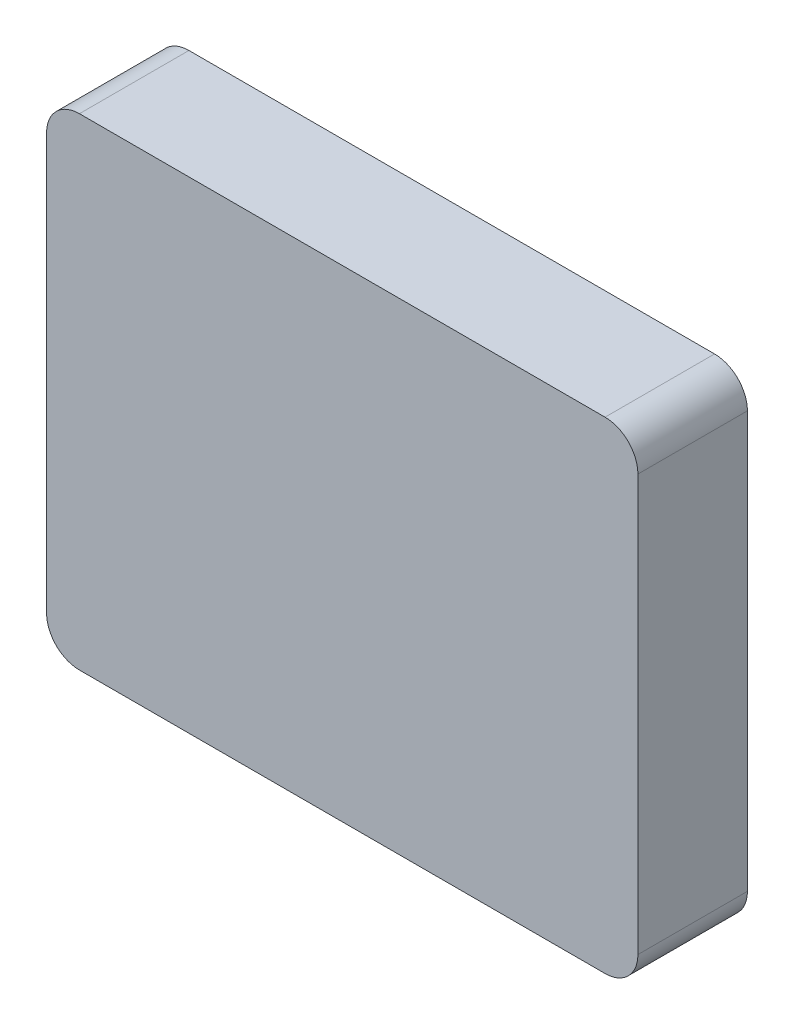
ISO-10303-21;
HEADER;
FILE_DESCRIPTION(('STEP AP214'),'2;1');
FILE_NAME('part.step','',(''),(''),'','','');
FILE_SCHEMA(('AUTOMOTIVE_DESIGN { 1 0 10303 214 1 1 1 1 }'));
ENDSEC;
DATA;
#1=APPLICATION_CONTEXT('core data for automotive mechanical design processes');
#2=APPLICATION_PROTOCOL_DEFINITION('international standard','automotive_design',2000,#1);
#3=PRODUCT_CONTEXT('',#1,'mechanical');
#4=PRODUCT('Part','Part','',(#3));
#5=PRODUCT_RELATED_PRODUCT_CATEGORY('part','',(#4));
#6=PRODUCT_DEFINITION_FORMATION('','',#4);
#7=PRODUCT_DEFINITION_CONTEXT('part definition',#1,'design');
#8=PRODUCT_DEFINITION('design','',#6,#7);
#9=PRODUCT_DEFINITION_SHAPE('','',#8);
#10=(LENGTH_UNIT() NAMED_UNIT(*) SI_UNIT(.MILLI.,.METRE.));
#11=(NAMED_UNIT(*) PLANE_ANGLE_UNIT() SI_UNIT($,.RADIAN.));
#12=(NAMED_UNIT(*) SI_UNIT($,.STERADIAN.) SOLID_ANGLE_UNIT());
#13=UNCERTAINTY_MEASURE_WITH_UNIT(LENGTH_MEASURE(1.E-05),#10,'distance_accuracy_value','');
#14=(GEOMETRIC_REPRESENTATION_CONTEXT(3) GLOBAL_UNCERTAINTY_ASSIGNED_CONTEXT((#13)) GLOBAL_UNIT_ASSIGNED_CONTEXT((#10,
#11,#12)) REPRESENTATION_CONTEXT('',''));
#15=CARTESIAN_POINT('',(0.,0.,0.));
#16=DIRECTION('',(0.,0.,1.));
#17=DIRECTION('',(1.,0.,0.));
#18=AXIS2_PLACEMENT_3D('',#15,#16,#17);
#19=CARTESIAN_POINT('',(0.,0.,0.));
#20=DIRECTION('',(0.,0.,1.));
#21=DIRECTION('',(1.,0.,0.));
#22=AXIS2_PLACEMENT_3D('',#19,#20,#21);
#23=PLANE('',#22);
#24=CARTESIAN_POINT('',(12.,9.5,0.));
#25=DIRECTION('',(0.,0.,1.));
#26=DIRECTION('',(1.,0.,0.));
#27=AXIS2_PLACEMENT_3D('',#24,#25,#26);
#28=CIRCLE('',#27,1.5);
#29=CARTESIAN_POINT('',(12.,11.,0.));
#30=VERTEX_POINT('',#29);
#31=CARTESIAN_POINT('',(13.5,9.5,0.));
#32=VERTEX_POINT('',#31);
#33=EDGE_CURVE('E36',#30,#32,#28,.F.);
#34=ORIENTED_EDGE('',*,*,#33,.T.);
#35=DIRECTION('',(0.,1.,0.));
#36=VECTOR('',#35,1.);
#37=CARTESIAN_POINT('',(13.5,11.,0.));
#38=LINE('',#37,#36);
#39=CARTESIAN_POINT('',(13.5,-9.5,0.));
#40=VERTEX_POINT('',#39);
#41=EDGE_CURVE('E203',#40,#32,#38,.T.);
#42=ORIENTED_EDGE('',*,*,#41,.F.);
#43=CARTESIAN_POINT('',(12.,-9.5,0.));
#44=DIRECTION('',(0.,0.,1.));
#45=DIRECTION('',(1.,0.,0.));
#46=AXIS2_PLACEMENT_3D('',#43,#44,#45);
#47=CIRCLE('',#46,1.5);
#48=CARTESIAN_POINT('',(12.,-11.,0.));
#49=VERTEX_POINT('',#48);
#50=EDGE_CURVE('E199',#40,#49,#47,.F.);
#51=ORIENTED_EDGE('',*,*,#50,.T.);
#52=DIRECTION('',(1.,0.,0.));
#53=VECTOR('',#52,1.);
#54=CARTESIAN_POINT('',(13.5,-11.,0.));
#55=LINE('',#54,#53);
#56=CARTESIAN_POINT('',(-12.,-11.,0.));
#57=VERTEX_POINT('',#56);
#58=EDGE_CURVE('E200',#57,#49,#55,.T.);
#59=ORIENTED_EDGE('',*,*,#58,.F.);
#60=CARTESIAN_POINT('',(-12.,-9.5,0.));
#61=DIRECTION('',(0.,0.,1.));
#62=DIRECTION('',(1.,0.,0.));
#63=AXIS2_PLACEMENT_3D('',#60,#61,#62);
#64=CIRCLE('',#63,1.5);
#65=CARTESIAN_POINT('',(-13.5,-9.5,0.));
#66=VERTEX_POINT('',#65);
#67=EDGE_CURVE('E196',#57,#66,#64,.F.);
#68=ORIENTED_EDGE('',*,*,#67,.T.);
#69=DIRECTION('',(0.,-1.,0.));
#70=VECTOR('',#69,1.);
#71=CARTESIAN_POINT('',(-13.5,11.,0.));
#72=LINE('',#71,#70);
#73=CARTESIAN_POINT('',(-13.5,9.5,0.));
#74=VERTEX_POINT('',#73);
#75=EDGE_CURVE('E202',#74,#66,#72,.T.);
#76=ORIENTED_EDGE('',*,*,#75,.F.);
#77=CARTESIAN_POINT('',(-12.,9.5,0.));
#78=DIRECTION('',(0.,0.,1.));
#79=DIRECTION('',(1.,0.,0.));
#80=AXIS2_PLACEMENT_3D('',#77,#78,#79);
#81=CIRCLE('',#80,1.5);
#82=CARTESIAN_POINT('',(-12.,11.,0.));
#83=VERTEX_POINT('',#82);
#84=EDGE_CURVE('E144',#74,#83,#81,.F.);
#85=ORIENTED_EDGE('',*,*,#84,.T.);
#86=DIRECTION('',(-1.,0.,0.));
#87=VECTOR('',#86,1.);
#88=CARTESIAN_POINT('',(13.5,11.,0.));
#89=LINE('',#88,#87);
#90=EDGE_CURVE('E173',#30,#83,#89,.T.);
#91=ORIENTED_EDGE('',*,*,#90,.F.);
#92=EDGE_LOOP('',(#34,#42,#51,#59,#68,#76,#85,#91));
#93=FACE_BOUND('',#92,.T.);
#94=DIRECTION('',(0.,-1.,0.));
#95=VECTOR('',#94,1.);
#96=CARTESIAN_POINT('',(-11.3,11.,0.));
#97=LINE('',#96,#95);
#98=CARTESIAN_POINT('',(-11.3,8.8,0.));
#99=VERTEX_POINT('',#98);
#100=CARTESIAN_POINT('',(-11.3,-8.8,0.));
#101=VERTEX_POINT('',#100);
#102=EDGE_CURVE('E194',#99,#101,#97,.T.);
#103=ORIENTED_EDGE('',*,*,#102,.T.);
#104=DIRECTION('',(1.,0.,0.));
#105=VECTOR('',#104,1.);
#106=CARTESIAN_POINT('',(13.5,-8.8,0.));
#107=LINE('',#106,#105);
#108=CARTESIAN_POINT('',(11.3,-8.8,0.));
#109=VERTEX_POINT('',#108);
#110=EDGE_CURVE('E191',#101,#109,#107,.T.);
#111=ORIENTED_EDGE('',*,*,#110,.T.);
#112=DIRECTION('',(0.,1.,0.));
#113=VECTOR('',#112,1.);
#114=CARTESIAN_POINT('',(11.3,11.,0.));
#115=LINE('',#114,#113);
#116=CARTESIAN_POINT('',(11.3,8.8,0.));
#117=VERTEX_POINT('',#116);
#118=EDGE_CURVE('E41',#109,#117,#115,.T.);
#119=ORIENTED_EDGE('',*,*,#118,.T.);
#120=DIRECTION('',(-1.,0.,0.));
#121=VECTOR('',#120,1.);
#122=CARTESIAN_POINT('',(13.5,8.8,0.));
#123=LINE('',#122,#121);
#124=EDGE_CURVE('E11',#117,#99,#123,.T.);
#125=ORIENTED_EDGE('',*,*,#124,.T.);
#126=EDGE_LOOP('',(#103,#111,#119,#125));
#127=FACE_BOUND('',#126,.T.);
#128=ADVANCED_FACE('F33',(#93,#127),#23,.F.);
#129=CARTESIAN_POINT('',(-11.3,11.,5.));
#130=DIRECTION('',(1.,0.,0.));
#131=DIRECTION('',(0.,1.,0.));
#132=AXIS2_PLACEMENT_3D('',#129,#130,#131);
#133=PLANE('',#132);
#134=ORIENTED_EDGE('',*,*,#102,.F.);
#135=DIRECTION('',(0.,0.,1.));
#136=VECTOR('',#135,1.);
#137=CARTESIAN_POINT('',(-11.3,8.8,5.));
#138=LINE('',#137,#136);
#139=CARTESIAN_POINT('',(-11.3,8.8,2.8));
#140=VERTEX_POINT('',#139);
#141=EDGE_CURVE('E183',#99,#140,#138,.T.);
#142=ORIENTED_EDGE('',*,*,#141,.T.);
#143=DIRECTION('',(0.,-1.,0.));
#144=VECTOR('',#143,1.);
#145=CARTESIAN_POINT('',(-11.3,0.,2.8));
#146=LINE('',#145,#144);
#147=CARTESIAN_POINT('',(-11.3,-8.8,2.8));
#148=VERTEX_POINT('',#147);
#149=EDGE_CURVE('E177',#140,#148,#146,.T.);
#150=ORIENTED_EDGE('',*,*,#149,.T.);
#151=DIRECTION('',(0.,0.,1.));
#152=VECTOR('',#151,1.);
#153=CARTESIAN_POINT('',(-11.3,-8.8,5.));
#154=LINE('',#153,#152);
#155=EDGE_CURVE('E169',#101,#148,#154,.T.);
#156=ORIENTED_EDGE('',*,*,#155,.F.);
#157=EDGE_LOOP('',(#134,#142,#150,#156));
#158=FACE_BOUND('',#157,.T.);
#159=ADVANCED_FACE('F247',(#158),#133,.T.);
#160=CARTESIAN_POINT('',(13.5,-8.8,5.));
#161=DIRECTION('',(0.,1.,0.));
#162=DIRECTION('',(-1.,0.,0.));
#163=AXIS2_PLACEMENT_3D('',#160,#161,#162);
#164=PLANE('',#163);
#165=ORIENTED_EDGE('',*,*,#110,.F.);
#166=ORIENTED_EDGE('',*,*,#155,.T.);
#167=DIRECTION('',(1.,0.,0.));
#168=VECTOR('',#167,1.);
#169=CARTESIAN_POINT('',(0.,-8.8,2.8));
#170=LINE('',#169,#168);
#171=CARTESIAN_POINT('',(11.3,-8.8,2.8));
#172=VERTEX_POINT('',#171);
#173=EDGE_CURVE('E174',#148,#172,#170,.T.);
#174=ORIENTED_EDGE('',*,*,#173,.T.);
#175=DIRECTION('',(0.,0.,1.));
#176=VECTOR('',#175,1.);
#177=CARTESIAN_POINT('',(11.3,-8.8,5.));
#178=LINE('',#177,#176);
#179=EDGE_CURVE('E187',#109,#172,#178,.T.);
#180=ORIENTED_EDGE('',*,*,#179,.F.);
#181=EDGE_LOOP('',(#165,#166,#174,#180));
#182=FACE_BOUND('',#181,.T.);
#183=ADVANCED_FACE('F251',(#182),#164,.T.);
#184=CARTESIAN_POINT('',(11.3,11.,5.));
#185=DIRECTION('',(-1.,0.,0.));
#186=DIRECTION('',(0.,-1.,0.));
#187=AXIS2_PLACEMENT_3D('',#184,#185,#186);
#188=PLANE('',#187);
#189=ORIENTED_EDGE('',*,*,#118,.F.);
#190=ORIENTED_EDGE('',*,*,#179,.T.);
#191=DIRECTION('',(0.,1.,0.));
#192=VECTOR('',#191,1.);
#193=CARTESIAN_POINT('',(11.3,0.,2.8));
#194=LINE('',#193,#192);
#195=CARTESIAN_POINT('',(11.3,8.8,2.8));
#196=VERTEX_POINT('',#195);
#197=EDGE_CURVE('E170',#172,#196,#194,.T.);
#198=ORIENTED_EDGE('',*,*,#197,.T.);
#199=DIRECTION('',(0.,0.,1.));
#200=VECTOR('',#199,1.);
#201=CARTESIAN_POINT('',(11.3,8.8,5.));
#202=LINE('',#201,#200);
#203=EDGE_CURVE('E185',#117,#196,#202,.T.);
#204=ORIENTED_EDGE('',*,*,#203,.F.);
#205=EDGE_LOOP('',(#189,#190,#198,#204));
#206=FACE_BOUND('',#205,.T.);
#207=ADVANCED_FACE('F256',(#206),#188,.T.);
#208=CARTESIAN_POINT('',(13.5,8.8,5.));
#209=DIRECTION('',(0.,-1.,0.));
#210=DIRECTION('',(1.,0.,0.));
#211=AXIS2_PLACEMENT_3D('',#208,#209,#210);
#212=PLANE('',#211);
#213=ORIENTED_EDGE('',*,*,#124,.F.);
#214=ORIENTED_EDGE('',*,*,#203,.T.);
#215=DIRECTION('',(-1.,0.,0.));
#216=VECTOR('',#215,1.);
#217=CARTESIAN_POINT('',(0.,8.8,2.8));
#218=LINE('',#217,#216);
#219=EDGE_CURVE('E180',#196,#140,#218,.T.);
#220=ORIENTED_EDGE('',*,*,#219,.T.);
#221=ORIENTED_EDGE('',*,*,#141,.F.);
#222=EDGE_LOOP('',(#213,#214,#220,#221));
#223=FACE_BOUND('',#222,.T.);
#224=ADVANCED_FACE('F262',(#223),#212,.T.);
#225=CARTESIAN_POINT('',(0.,0.,2.8));
#226=DIRECTION('',(0.,0.,-1.));
#227=DIRECTION('',(-1.,0.,0.));
#228=AXIS2_PLACEMENT_3D('',#225,#226,#227);
#229=PLANE('',#228);
#230=ORIENTED_EDGE('',*,*,#219,.F.);
#231=ORIENTED_EDGE('',*,*,#197,.F.);
#232=ORIENTED_EDGE('',*,*,#173,.F.);
#233=ORIENTED_EDGE('',*,*,#149,.F.);
#234=EDGE_LOOP('',(#230,#231,#232,#233));
#235=FACE_BOUND('',#234,.T.);
#236=ADVANCED_FACE('F265',(#235),#229,.T.);
#237=CARTESIAN_POINT('',(-13.5,11.,5.));
#238=DIRECTION('',(1.,0.,0.));
#239=DIRECTION('',(0.,1.,0.));
#240=AXIS2_PLACEMENT_3D('',#237,#238,#239);
#241=PLANE('',#240);
#242=DIRECTION('',(0.,0.,-1.));
#243=VECTOR('',#242,1.);
#244=CARTESIAN_POINT('',(-13.5,9.5,5.));
#245=LINE('',#244,#243);
#246=CARTESIAN_POINT('',(-13.5,9.5,5.));
#247=VERTEX_POINT('',#246);
#248=EDGE_CURVE('E137',#247,#74,#245,.T.);
#249=ORIENTED_EDGE('',*,*,#248,.T.);
#250=ORIENTED_EDGE('',*,*,#75,.T.);
#251=DIRECTION('',(0.,0.,-1.));
#252=VECTOR('',#251,1.);
#253=CARTESIAN_POINT('',(-13.5,-9.5,5.));
#254=LINE('',#253,#252);
#255=CARTESIAN_POINT('',(-13.5,-9.5,5.));
#256=VERTEX_POINT('',#255);
#257=EDGE_CURVE('E139',#66,#256,#254,.F.);
#258=ORIENTED_EDGE('',*,*,#257,.T.);
#259=DIRECTION('',(0.,-1.,0.));
#260=VECTOR('',#259,1.);
#261=CARTESIAN_POINT('',(-13.5,11.,5.));
#262=LINE('',#261,#260);
#263=EDGE_CURVE('E124',#247,#256,#262,.T.);
#264=ORIENTED_EDGE('',*,*,#263,.F.);
#265=EDGE_LOOP('',(#249,#250,#258,#264));
#266=FACE_BOUND('',#265,.T.);
#267=ADVANCED_FACE('F136',(#266),#241,.F.);
#268=CARTESIAN_POINT('',(13.5,-11.,5.));
#269=DIRECTION('',(0.,1.,0.));
#270=DIRECTION('',(-1.,0.,0.));
#271=AXIS2_PLACEMENT_3D('',#268,#269,#270);
#272=PLANE('',#271);
#273=DIRECTION('',(0.,0.,-1.));
#274=VECTOR('',#273,1.);
#275=CARTESIAN_POINT('',(-12.,-11.,5.));
#276=LINE('',#275,#274);
#277=CARTESIAN_POINT('',(-12.,-11.,5.));
#278=VERTEX_POINT('',#277);
#279=EDGE_CURVE('E164',#278,#57,#276,.T.);
#280=ORIENTED_EDGE('',*,*,#279,.T.);
#281=ORIENTED_EDGE('',*,*,#58,.T.);
#282=DIRECTION('',(0.,0.,-1.));
#283=VECTOR('',#282,1.);
#284=CARTESIAN_POINT('',(12.,-11.,5.));
#285=LINE('',#284,#283);
#286=CARTESIAN_POINT('',(12.,-11.,5.));
#287=VERTEX_POINT('',#286);
#288=EDGE_CURVE('E167',#49,#287,#285,.F.);
#289=ORIENTED_EDGE('',*,*,#288,.T.);
#290=DIRECTION('',(1.,0.,0.));
#291=VECTOR('',#290,1.);
#292=CARTESIAN_POINT('',(13.5,-11.,5.));
#293=LINE('',#292,#291);
#294=EDGE_CURVE('E140',#278,#287,#293,.T.);
#295=ORIENTED_EDGE('',*,*,#294,.F.);
#296=EDGE_LOOP('',(#280,#281,#289,#295));
#297=FACE_BOUND('',#296,.T.);
#298=ADVANCED_FACE('F236',(#297),#272,.F.);
#299=CARTESIAN_POINT('',(13.5,11.,5.));
#300=DIRECTION('',(-1.,0.,0.));
#301=DIRECTION('',(0.,-1.,0.));
#302=AXIS2_PLACEMENT_3D('',#299,#300,#301);
#303=PLANE('',#302);
#304=DIRECTION('',(0.,0.,-1.));
#305=VECTOR('',#304,1.);
#306=CARTESIAN_POINT('',(13.5,-9.5,5.));
#307=LINE('',#306,#305);
#308=CARTESIAN_POINT('',(13.5,-9.5,5.));
#309=VERTEX_POINT('',#308);
#310=EDGE_CURVE('E131',#309,#40,#307,.T.);
#311=ORIENTED_EDGE('',*,*,#310,.T.);
#312=ORIENTED_EDGE('',*,*,#41,.T.);
#313=DIRECTION('',(0.,0.,-1.));
#314=VECTOR('',#313,1.);
#315=CARTESIAN_POINT('',(13.5,9.5,5.));
#316=LINE('',#315,#314);
#317=CARTESIAN_POINT('',(13.5,9.5,5.));
#318=VERTEX_POINT('',#317);
#319=EDGE_CURVE('E162',#32,#318,#316,.F.);
#320=ORIENTED_EDGE('',*,*,#319,.T.);
#321=DIRECTION('',(0.,1.,0.));
#322=VECTOR('',#321,1.);
#323=CARTESIAN_POINT('',(13.5,11.,5.));
#324=LINE('',#323,#322);
#325=EDGE_CURVE('E222',#309,#318,#324,.T.);
#326=ORIENTED_EDGE('',*,*,#325,.F.);
#327=EDGE_LOOP('',(#311,#312,#320,#326));
#328=FACE_BOUND('',#327,.T.);
#329=ADVANCED_FACE('F211',(#328),#303,.F.);
#330=CARTESIAN_POINT('',(13.5,11.,5.));
#331=DIRECTION('',(0.,-1.,0.));
#332=DIRECTION('',(1.,0.,0.));
#333=AXIS2_PLACEMENT_3D('',#330,#331,#332);
#334=PLANE('',#333);
#335=DIRECTION('',(0.,0.,-1.));
#336=VECTOR('',#335,1.);
#337=CARTESIAN_POINT('',(12.,11.,5.));
#338=LINE('',#337,#336);
#339=CARTESIAN_POINT('',(12.,11.,5.));
#340=VERTEX_POINT('',#339);
#341=EDGE_CURVE('E146',#340,#30,#338,.T.);
#342=ORIENTED_EDGE('',*,*,#341,.T.);
#343=ORIENTED_EDGE('',*,*,#90,.T.);
#344=DIRECTION('',(0.,0.,-1.));
#345=VECTOR('',#344,1.);
#346=CARTESIAN_POINT('',(-12.,11.,5.));
#347=LINE('',#346,#345);
#348=CARTESIAN_POINT('',(-12.,11.,5.));
#349=VERTEX_POINT('',#348);
#350=EDGE_CURVE('E149',#83,#349,#347,.F.);
#351=ORIENTED_EDGE('',*,*,#350,.T.);
#352=DIRECTION('',(-1.,0.,0.));
#353=VECTOR('',#352,1.);
#354=CARTESIAN_POINT('',(13.5,11.,5.));
#355=LINE('',#354,#353);
#356=EDGE_CURVE('E127',#340,#349,#355,.T.);
#357=ORIENTED_EDGE('',*,*,#356,.F.);
#358=EDGE_LOOP('',(#342,#343,#351,#357));
#359=FACE_BOUND('',#358,.T.);
#360=ADVANCED_FACE('F224',(#359),#334,.F.);
#361=CARTESIAN_POINT('',(0.,0.,5.));
#362=DIRECTION('',(0.,0.,-1.));
#363=DIRECTION('',(-1.,0.,0.));
#364=AXIS2_PLACEMENT_3D('',#361,#362,#363);
#365=PLANE('',#364);
#366=ORIENTED_EDGE('',*,*,#356,.T.);
#367=CARTESIAN_POINT('',(-12.,9.5,5.));
#368=DIRECTION('',(0.,0.,-1.));
#369=DIRECTION('',(-1.,0.,0.));
#370=AXIS2_PLACEMENT_3D('',#367,#368,#369);
#371=CIRCLE('',#370,1.5);
#372=EDGE_CURVE('E121',#349,#247,#371,.F.);
#373=ORIENTED_EDGE('',*,*,#372,.T.);
#374=ORIENTED_EDGE('',*,*,#263,.T.);
#375=CARTESIAN_POINT('',(-12.,-9.5,5.));
#376=DIRECTION('',(0.,0.,-1.));
#377=DIRECTION('',(-1.,0.,0.));
#378=AXIS2_PLACEMENT_3D('',#375,#376,#377);
#379=CIRCLE('',#378,1.5);
#380=EDGE_CURVE('E155',#256,#278,#379,.F.);
#381=ORIENTED_EDGE('',*,*,#380,.T.);
#382=ORIENTED_EDGE('',*,*,#294,.T.);
#383=CARTESIAN_POINT('',(12.,-9.5,5.));
#384=DIRECTION('',(0.,0.,-1.));
#385=DIRECTION('',(-1.,0.,0.));
#386=AXIS2_PLACEMENT_3D('',#383,#384,#385);
#387=CIRCLE('',#386,1.5);
#388=EDGE_CURVE('E157',#287,#309,#387,.F.);
#389=ORIENTED_EDGE('',*,*,#388,.T.);
#390=ORIENTED_EDGE('',*,*,#325,.T.);
#391=CARTESIAN_POINT('',(12.,9.5,5.));
#392=DIRECTION('',(0.,0.,-1.));
#393=DIRECTION('',(-1.,0.,0.));
#394=AXIS2_PLACEMENT_3D('',#391,#392,#393);
#395=CIRCLE('',#394,1.5);
#396=EDGE_CURVE('E132',#318,#340,#395,.F.);
#397=ORIENTED_EDGE('',*,*,#396,.T.);
#398=EDGE_LOOP('',(#366,#373,#374,#381,#382,#389,#390,#397));
#399=FACE_BOUND('',#398,.T.);
#400=ADVANCED_FACE('F123',(#399),#365,.F.);
#401=CARTESIAN_POINT('',(-12.,9.5,5.));
#402=DIRECTION('',(0.,0.,-1.));
#403=DIRECTION('',(-1.,0.,0.));
#404=AXIS2_PLACEMENT_3D('',#401,#402,#403);
#405=CYLINDRICAL_SURFACE('',#404,1.5);
#406=ORIENTED_EDGE('',*,*,#84,.F.);
#407=ORIENTED_EDGE('',*,*,#248,.F.);
#408=ORIENTED_EDGE('',*,*,#372,.F.);
#409=ORIENTED_EDGE('',*,*,#350,.F.);
#410=EDGE_LOOP('',(#406,#407,#408,#409));
#411=FACE_BOUND('',#410,.T.);
#412=ADVANCED_FACE('F142',(#411),#405,.T.);
#413=CARTESIAN_POINT('',(12.,9.5,5.));
#414=DIRECTION('',(0.,0.,-1.));
#415=DIRECTION('',(-1.,0.,0.));
#416=AXIS2_PLACEMENT_3D('',#413,#414,#415);
#417=CYLINDRICAL_SURFACE('',#416,1.5);
#418=ORIENTED_EDGE('',*,*,#33,.F.);
#419=ORIENTED_EDGE('',*,*,#341,.F.);
#420=ORIENTED_EDGE('',*,*,#396,.F.);
#421=ORIENTED_EDGE('',*,*,#319,.F.);
#422=EDGE_LOOP('',(#418,#419,#420,#421));
#423=FACE_BOUND('',#422,.T.);
#424=ADVANCED_FACE('F221',(#423),#417,.T.);
#425=CARTESIAN_POINT('',(12.,-9.5,5.));
#426=DIRECTION('',(0.,0.,-1.));
#427=DIRECTION('',(-1.,0.,0.));
#428=AXIS2_PLACEMENT_3D('',#425,#426,#427);
#429=CYLINDRICAL_SURFACE('',#428,1.5);
#430=ORIENTED_EDGE('',*,*,#50,.F.);
#431=ORIENTED_EDGE('',*,*,#310,.F.);
#432=ORIENTED_EDGE('',*,*,#388,.F.);
#433=ORIENTED_EDGE('',*,*,#288,.F.);
#434=EDGE_LOOP('',(#430,#431,#432,#433));
#435=FACE_BOUND('',#434,.T.);
#436=ADVANCED_FACE('F234',(#435),#429,.T.);
#437=CARTESIAN_POINT('',(-12.,-9.5,5.));
#438=DIRECTION('',(0.,0.,-1.));
#439=DIRECTION('',(-1.,0.,0.));
#440=AXIS2_PLACEMENT_3D('',#437,#438,#439);
#441=CYLINDRICAL_SURFACE('',#440,1.5);
#442=ORIENTED_EDGE('',*,*,#67,.F.);
#443=ORIENTED_EDGE('',*,*,#279,.F.);
#444=ORIENTED_EDGE('',*,*,#380,.F.);
#445=ORIENTED_EDGE('',*,*,#257,.F.);
#446=EDGE_LOOP('',(#442,#443,#444,#445));
#447=FACE_BOUND('',#446,.T.);
#448=ADVANCED_FACE('F238',(#447),#441,.T.);
#449=CLOSED_SHELL('',(#128,#159,#183,#207,#224,#236,#267,#298,#329,#360,#400,#412,#424,#436,#448));
#450=MANIFOLD_SOLID_BREP('B2',#449);
#451=ADVANCED_BREP_SHAPE_REPRESENTATION('',(#18,#450),#14);
#452=SHAPE_DEFINITION_REPRESENTATION(#9,#451);
ENDSEC;
END-ISO-10303-21;
